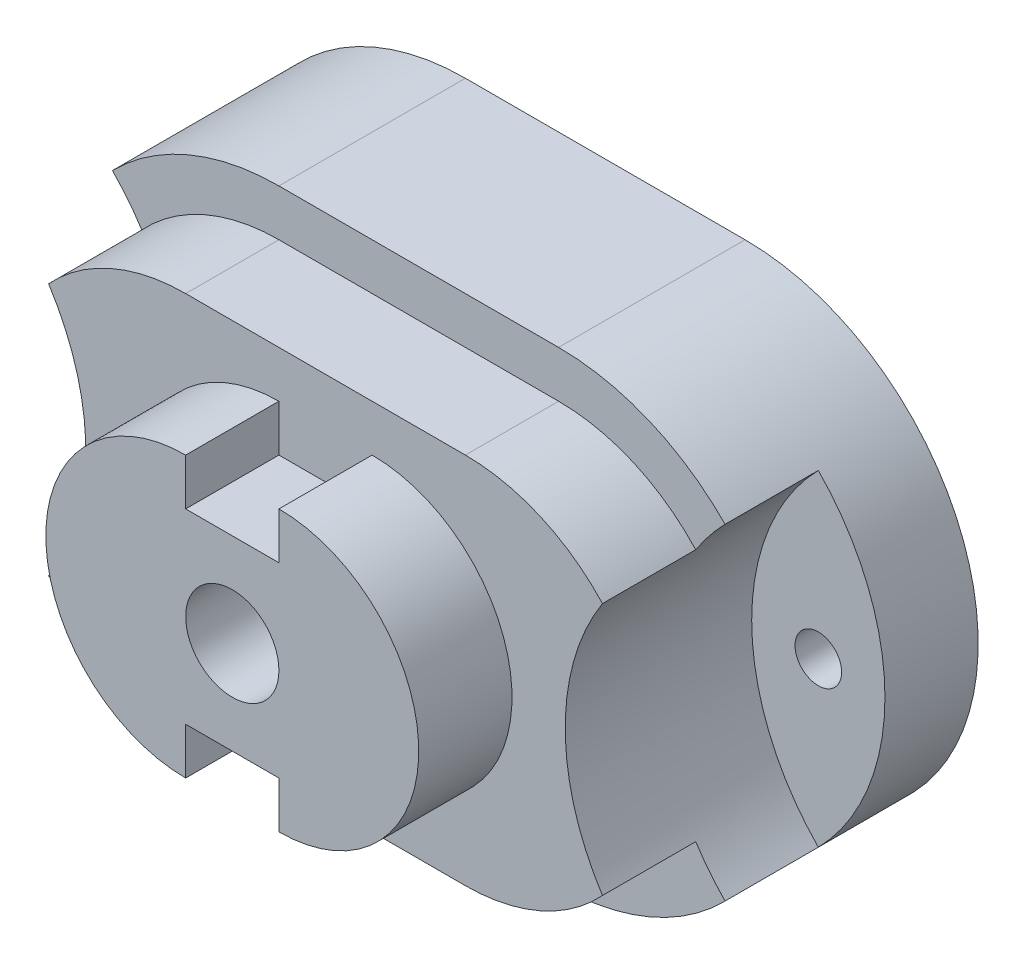
ISO-10303-21;
HEADER;
FILE_DESCRIPTION(('STEP AP214'),'2;1');
FILE_NAME('part.step','',(''),(''),'','','');
FILE_SCHEMA(('AUTOMOTIVE_DESIGN { 1 0 10303 214 1 1 1 1 }'));
ENDSEC;
DATA;
#1=APPLICATION_CONTEXT('core data for automotive mechanical design processes');
#2=APPLICATION_PROTOCOL_DEFINITION('international standard','automotive_design',2000,#1);
#3=PRODUCT_CONTEXT('',#1,'mechanical');
#4=PRODUCT('Part','Part','',(#3));
#5=PRODUCT_RELATED_PRODUCT_CATEGORY('part','',(#4));
#6=PRODUCT_DEFINITION_FORMATION('','',#4);
#7=PRODUCT_DEFINITION_CONTEXT('part definition',#1,'design');
#8=PRODUCT_DEFINITION('design','',#6,#7);
#9=PRODUCT_DEFINITION_SHAPE('','',#8);
#10=(LENGTH_UNIT() NAMED_UNIT(*) SI_UNIT(.MILLI.,.METRE.));
#11=(NAMED_UNIT(*) PLANE_ANGLE_UNIT() SI_UNIT($,.RADIAN.));
#12=(NAMED_UNIT(*) SI_UNIT($,.STERADIAN.) SOLID_ANGLE_UNIT());
#13=UNCERTAINTY_MEASURE_WITH_UNIT(LENGTH_MEASURE(1.E-05),#10,'distance_accuracy_value','');
#14=(GEOMETRIC_REPRESENTATION_CONTEXT(3) GLOBAL_UNCERTAINTY_ASSIGNED_CONTEXT((#13)) GLOBAL_UNIT_ASSIGNED_CONTEXT((#10,
#11,#12)) REPRESENTATION_CONTEXT('',''));
#15=CARTESIAN_POINT('',(0.,0.,0.));
#16=DIRECTION('',(0.,0.,1.));
#17=DIRECTION('',(1.,0.,0.));
#18=AXIS2_PLACEMENT_3D('',#15,#16,#17);
#19=CARTESIAN_POINT('',(-30.,25.,30.));
#20=DIRECTION('',(0.,0.,1.));
#21=DIRECTION('',(1.,0.,0.));
#22=AXIS2_PLACEMENT_3D('',#19,#20,#21);
#23=PLANE('',#22);
#24=CARTESIAN_POINT('',(35.7071421427143,25.,30.));
#25=DIRECTION('',(0.,0.,1.));
#26=DIRECTION('',(1.,0.,0.));
#27=AXIS2_PLACEMENT_3D('',#24,#25,#26);
#28=CIRCLE('',#27,25.);
#29=CARTESIAN_POINT('',(14.7029408822941,38.558153613666,30.));
#30=VERTEX_POINT('',#29);
#31=CARTESIAN_POINT('',(14.7029408822941,11.441846386334,30.));
#32=VERTEX_POINT('',#31);
#33=EDGE_CURVE('E11',#30,#32,#28,.T.);
#34=ORIENTED_EDGE('',*,*,#33,.F.);
#35=CARTESIAN_POINT('',(0.,25.,30.));
#36=DIRECTION('',(0.,0.,1.));
#37=DIRECTION('',(1.,0.,0.));
#38=AXIS2_PLACEMENT_3D('',#35,#36,#37);
#39=CIRCLE('',#38,20.);
#40=CARTESIAN_POINT('',(0.,45.,30.));
#41=VERTEX_POINT('',#40);
#42=EDGE_CURVE('E308',#30,#41,#39,.T.);
#43=ORIENTED_EDGE('',*,*,#42,.T.);
#44=DIRECTION('',(-1.,0.,0.));
#45=VECTOR('',#44,1.);
#46=CARTESIAN_POINT('',(-30.,45.,30.));
#47=LINE('',#46,#45);
#48=CARTESIAN_POINT('',(-30.,45.,30.));
#49=VERTEX_POINT('',#48);
#50=EDGE_CURVE('E312',#41,#49,#47,.T.);
#51=ORIENTED_EDGE('',*,*,#50,.T.);
#52=CARTESIAN_POINT('',(-30.,25.,30.));
#53=DIRECTION('',(0.,0.,1.));
#54=DIRECTION('',(1.,0.,0.));
#55=AXIS2_PLACEMENT_3D('',#52,#53,#54);
#56=CIRCLE('',#55,20.);
#57=CARTESIAN_POINT('',(-44.7029408822941,38.558153613666,30.));
#58=VERTEX_POINT('',#57);
#59=EDGE_CURVE('E302',#49,#58,#56,.T.);
#60=ORIENTED_EDGE('',*,*,#59,.T.);
#61=CARTESIAN_POINT('',(-65.7071421427142,25.,30.));
#62=DIRECTION('',(0.,0.,1.));
#63=DIRECTION('',(1.,0.,0.));
#64=AXIS2_PLACEMENT_3D('',#61,#62,#63);
#65=CIRCLE('',#64,25.);
#66=CARTESIAN_POINT('',(-44.7029408822941,11.441846386334,30.));
#67=VERTEX_POINT('',#66);
#68=EDGE_CURVE('E41',#67,#58,#65,.T.);
#69=ORIENTED_EDGE('',*,*,#68,.F.);
#70=CARTESIAN_POINT('',(-30.,5.,30.));
#71=VERTEX_POINT('',#70);
#72=EDGE_CURVE('E306',#67,#71,#56,.T.);
#73=ORIENTED_EDGE('',*,*,#72,.T.);
#74=DIRECTION('',(1.,0.,0.));
#75=VECTOR('',#74,1.);
#76=CARTESIAN_POINT('',(-30.,5.,30.));
#77=LINE('',#76,#75);
#78=CARTESIAN_POINT('',(0.,4.99999999999999,30.));
#79=VERTEX_POINT('',#78);
#80=EDGE_CURVE('E305',#71,#79,#77,.T.);
#81=ORIENTED_EDGE('',*,*,#80,.T.);
#82=EDGE_CURVE('E309',#79,#32,#39,.T.);
#83=ORIENTED_EDGE('',*,*,#82,.T.);
#84=EDGE_LOOP('',(#34,#43,#51,#60,#69,#73,#81,#83));
#85=FACE_BOUND('',#84,.T.);
#86=DIRECTION('',(0.,1.,0.));
#87=VECTOR('',#86,1.);
#88=CARTESIAN_POINT('',(-20.,10.,30.));
#89=LINE('',#88,#87);
#90=CARTESIAN_POINT('',(-20.,10.,30.));
#91=VERTEX_POINT('',#90);
#92=CARTESIAN_POINT('',(-20.,15.,30.));
#93=VERTEX_POINT('',#92);
#94=EDGE_CURVE('E244',#91,#93,#89,.T.);
#95=ORIENTED_EDGE('',*,*,#94,.F.);
#96=CARTESIAN_POINT('',(-20.,25.,30.));
#97=DIRECTION('',(0.,0.,1.));
#98=DIRECTION('',(-1.,0.,0.));
#99=AXIS2_PLACEMENT_3D('',#96,#97,#98);
#100=CIRCLE('',#99,15.);
#101=CARTESIAN_POINT('',(-20.,40.,30.));
#102=VERTEX_POINT('',#101);
#103=EDGE_CURVE('E222',#102,#91,#100,.T.);
#104=ORIENTED_EDGE('',*,*,#103,.F.);
#105=DIRECTION('',(0.,1.,0.));
#106=VECTOR('',#105,1.);
#107=CARTESIAN_POINT('',(-20.,40.,30.));
#108=LINE('',#107,#106);
#109=CARTESIAN_POINT('',(-20.,35.,30.));
#110=VERTEX_POINT('',#109);
#111=EDGE_CURVE('E227',#110,#102,#108,.T.);
#112=ORIENTED_EDGE('',*,*,#111,.F.);
#113=DIRECTION('',(-1.,0.,0.));
#114=VECTOR('',#113,1.);
#115=CARTESIAN_POINT('',(-20.,35.,30.));
#116=LINE('',#115,#114);
#117=CARTESIAN_POINT('',(-10.,35.,30.));
#118=VERTEX_POINT('',#117);
#119=EDGE_CURVE('E254',#118,#110,#116,.T.);
#120=ORIENTED_EDGE('',*,*,#119,.F.);
#121=DIRECTION('',(0.,-1.,0.));
#122=VECTOR('',#121,1.);
#123=CARTESIAN_POINT('',(-10.,35.,30.));
#124=LINE('',#123,#122);
#125=CARTESIAN_POINT('',(-10.,40.,30.));
#126=VERTEX_POINT('',#125);
#127=EDGE_CURVE('E252',#126,#118,#124,.T.);
#128=ORIENTED_EDGE('',*,*,#127,.F.);
#129=CARTESIAN_POINT('',(-9.99999999999999,25.,30.));
#130=DIRECTION('',(0.,0.,1.));
#131=DIRECTION('',(1.,0.,0.));
#132=AXIS2_PLACEMENT_3D('',#129,#130,#131);
#133=CIRCLE('',#132,15.);
#134=CARTESIAN_POINT('',(-9.99999999999998,10.,30.));
#135=VERTEX_POINT('',#134);
#136=EDGE_CURVE('E250',#135,#126,#133,.T.);
#137=ORIENTED_EDGE('',*,*,#136,.F.);
#138=DIRECTION('',(0.,-1.,0.));
#139=VECTOR('',#138,1.);
#140=CARTESIAN_POINT('',(-9.99999999999998,15.,30.));
#141=LINE('',#140,#139);
#142=CARTESIAN_POINT('',(-9.99999999999998,15.,30.));
#143=VERTEX_POINT('',#142);
#144=EDGE_CURVE('E248',#143,#135,#141,.T.);
#145=ORIENTED_EDGE('',*,*,#144,.F.);
#146=DIRECTION('',(1.,0.,0.));
#147=VECTOR('',#146,1.);
#148=CARTESIAN_POINT('',(-20.,15.,30.));
#149=LINE('',#148,#147);
#150=EDGE_CURVE('E246',#93,#143,#149,.T.);
#151=ORIENTED_EDGE('',*,*,#150,.F.);
#152=EDGE_LOOP('',(#95,#104,#112,#120,#128,#137,#145,#151));
#153=FACE_BOUND('',#152,.T.);
#154=ADVANCED_FACE('F33',(#85,#153),#23,.T.);
#155=CARTESIAN_POINT('',(0.,25.,30.));
#156=DIRECTION('',(0.,0.,-1.));
#157=DIRECTION('',(-1.,0.,0.));
#158=AXIS2_PLACEMENT_3D('',#155,#156,#157);
#159=CYLINDRICAL_SURFACE('',#158,20.);
#160=CARTESIAN_POINT('',(0.,25.,20.));
#161=DIRECTION('',(0.,0.,1.));
#162=DIRECTION('',(1.,0.,0.));
#163=AXIS2_PLACEMENT_3D('',#160,#161,#162);
#164=CIRCLE('',#163,20.);
#165=CARTESIAN_POINT('',(0.,4.99999999999999,20.));
#166=VERTEX_POINT('',#165);
#167=CARTESIAN_POINT('',(14.7029408822941,11.441846386334,20.));
#168=VERTEX_POINT('',#167);
#169=EDGE_CURVE('E321',#166,#168,#164,.T.);
#170=ORIENTED_EDGE('',*,*,#169,.T.);
#171=DIRECTION('',(0.,0.,1.));
#172=VECTOR('',#171,1.);
#173=CARTESIAN_POINT('',(14.7029408822941,11.441846386334,20.));
#174=LINE('',#173,#172);
#175=EDGE_CURVE('E283',#168,#32,#174,.T.);
#176=ORIENTED_EDGE('',*,*,#175,.T.);
#177=ORIENTED_EDGE('',*,*,#82,.F.);
#178=DIRECTION('',(0.,0.,-1.));
#179=VECTOR('',#178,1.);
#180=CARTESIAN_POINT('',(0.,4.99999999999999,30.));
#181=LINE('',#180,#179);
#182=EDGE_CURVE('E333',#79,#166,#181,.T.);
#183=ORIENTED_EDGE('',*,*,#182,.T.);
#184=EDGE_LOOP('',(#170,#176,#177,#183));
#185=FACE_BOUND('',#184,.T.);
#186=ADVANCED_FACE('F446',(#185),#159,.T.);
#187=CARTESIAN_POINT('',(-30.,25.,30.));
#188=DIRECTION('',(0.,0.,-1.));
#189=DIRECTION('',(-1.,0.,0.));
#190=AXIS2_PLACEMENT_3D('',#187,#188,#189);
#191=CYLINDRICAL_SURFACE('',#190,20.);
#192=CARTESIAN_POINT('',(-30.,25.,20.));
#193=DIRECTION('',(0.,0.,1.));
#194=DIRECTION('',(1.,0.,0.));
#195=AXIS2_PLACEMENT_3D('',#192,#193,#194);
#196=CIRCLE('',#195,20.);
#197=CARTESIAN_POINT('',(-30.,45.,20.));
#198=VERTEX_POINT('',#197);
#199=CARTESIAN_POINT('',(-44.7029408822941,38.558153613666,20.));
#200=VERTEX_POINT('',#199);
#201=EDGE_CURVE('E301',#198,#200,#196,.T.);
#202=ORIENTED_EDGE('',*,*,#201,.T.);
#203=DIRECTION('',(0.,0.,1.));
#204=VECTOR('',#203,1.);
#205=CARTESIAN_POINT('',(-44.7029408822941,38.558153613666,25.));
#206=LINE('',#205,#204);
#207=EDGE_CURVE('E296',#200,#58,#206,.T.);
#208=ORIENTED_EDGE('',*,*,#207,.T.);
#209=ORIENTED_EDGE('',*,*,#59,.F.);
#210=DIRECTION('',(0.,0.,-1.));
#211=VECTOR('',#210,1.);
#212=CARTESIAN_POINT('',(-30.,45.,30.));
#213=LINE('',#212,#211);
#214=EDGE_CURVE('E314',#49,#198,#213,.T.);
#215=ORIENTED_EDGE('',*,*,#214,.T.);
#216=EDGE_LOOP('',(#202,#208,#209,#215));
#217=FACE_BOUND('',#216,.T.);
#218=ADVANCED_FACE('F414',(#217),#191,.T.);
#219=CARTESIAN_POINT('',(-30.,25.,20.));
#220=DIRECTION('',(0.,0.,1.));
#221=DIRECTION('',(1.,0.,0.));
#222=AXIS2_PLACEMENT_3D('',#219,#220,#221);
#223=PLANE('',#222);
#224=CARTESIAN_POINT('',(35.7071421427143,25.,20.));
#225=DIRECTION('',(0.,0.,1.));
#226=DIRECTION('',(1.,0.,0.));
#227=AXIS2_PLACEMENT_3D('',#224,#225,#226);
#228=CIRCLE('',#227,25.);
#229=CARTESIAN_POINT('',(17.8535710713571,42.5,20.));
#230=VERTEX_POINT('',#229);
#231=CARTESIAN_POINT('',(14.7029408822941,38.558153613666,20.));
#232=VERTEX_POINT('',#231);
#233=EDGE_CURVE('E281',#230,#232,#228,.T.);
#234=ORIENTED_EDGE('',*,*,#233,.F.);
#235=CARTESIAN_POINT('',(0.,25.,20.));
#236=DIRECTION('',(0.,0.,1.));
#237=DIRECTION('',(1.,0.,0.));
#238=AXIS2_PLACEMENT_3D('',#235,#236,#237);
#239=CIRCLE('',#238,25.);
#240=CARTESIAN_POINT('',(0.,50.,20.));
#241=VERTEX_POINT('',#240);
#242=EDGE_CURVE('E362',#230,#241,#239,.T.);
#243=ORIENTED_EDGE('',*,*,#242,.T.);
#244=DIRECTION('',(-1.,0.,0.));
#245=VECTOR('',#244,1.);
#246=CARTESIAN_POINT('',(-30.,50.,20.));
#247=LINE('',#246,#245);
#248=CARTESIAN_POINT('',(-30.,50.,20.));
#249=VERTEX_POINT('',#248);
#250=EDGE_CURVE('E366',#241,#249,#247,.T.);
#251=ORIENTED_EDGE('',*,*,#250,.T.);
#252=CARTESIAN_POINT('',(-30.,25.,20.));
#253=DIRECTION('',(0.,0.,1.));
#254=DIRECTION('',(1.,0.,0.));
#255=AXIS2_PLACEMENT_3D('',#252,#253,#254);
#256=CIRCLE('',#255,25.);
#257=CARTESIAN_POINT('',(-47.8535710713571,42.5,20.));
#258=VERTEX_POINT('',#257);
#259=EDGE_CURVE('E356',#249,#258,#256,.T.);
#260=ORIENTED_EDGE('',*,*,#259,.T.);
#261=CARTESIAN_POINT('',(-65.7071421427142,25.,20.));
#262=DIRECTION('',(0.,0.,1.));
#263=DIRECTION('',(1.,0.,0.));
#264=AXIS2_PLACEMENT_3D('',#261,#262,#263);
#265=CIRCLE('',#264,25.);
#266=EDGE_CURVE('E299',#200,#258,#265,.T.);
#267=ORIENTED_EDGE('',*,*,#266,.F.);
#268=ORIENTED_EDGE('',*,*,#201,.F.);
#269=DIRECTION('',(-1.,0.,0.));
#270=VECTOR('',#269,1.);
#271=CARTESIAN_POINT('',(-30.,45.,20.));
#272=LINE('',#271,#270);
#273=CARTESIAN_POINT('',(0.,45.,20.));
#274=VERTEX_POINT('',#273);
#275=EDGE_CURVE('E324',#274,#198,#272,.T.);
#276=ORIENTED_EDGE('',*,*,#275,.F.);
#277=EDGE_CURVE('E325',#232,#274,#164,.T.);
#278=ORIENTED_EDGE('',*,*,#277,.F.);
#279=EDGE_LOOP('',(#234,#243,#251,#260,#267,#268,#276,#278));
#280=FACE_BOUND('',#279,.T.);
#281=ADVANCED_FACE('F419',(#280),#223,.T.);
#282=CARTESIAN_POINT('',(-30.,25.,20.));
#283=DIRECTION('',(0.,0.,-1.));
#284=DIRECTION('',(-1.,0.,0.));
#285=AXIS2_PLACEMENT_3D('',#282,#283,#284);
#286=CYLINDRICAL_SURFACE('',#285,25.);
#287=CARTESIAN_POINT('',(-47.8535710713571,7.50000000000001,20.));
#288=VERTEX_POINT('',#287);
#289=CARTESIAN_POINT('',(-30.,0.,20.));
#290=VERTEX_POINT('',#289);
#291=EDGE_CURVE('E360',#288,#290,#256,.T.);
#292=ORIENTED_EDGE('',*,*,#291,.F.);
#293=DIRECTION('',(0.,0.,1.));
#294=VECTOR('',#293,1.);
#295=CARTESIAN_POINT('',(-47.8535710713571,7.5,10.));
#296=LINE('',#295,#294);
#297=CARTESIAN_POINT('',(-47.8535710713571,7.50000000000001,10.));
#298=VERTEX_POINT('',#297);
#299=EDGE_CURVE('E350',#298,#288,#296,.T.);
#300=ORIENTED_EDGE('',*,*,#299,.F.);
#301=CARTESIAN_POINT('',(-30.,25.,10.));
#302=DIRECTION('',(0.,0.,1.));
#303=DIRECTION('',(1.,0.,0.));
#304=AXIS2_PLACEMENT_3D('',#301,#302,#303);
#305=CIRCLE('',#304,25.);
#306=CARTESIAN_POINT('',(-47.8535710713571,42.5,10.));
#307=VERTEX_POINT('',#306);
#308=EDGE_CURVE('E346',#307,#298,#305,.T.);
#309=ORIENTED_EDGE('',*,*,#308,.F.);
#310=DIRECTION('',(0.,0.,1.));
#311=VECTOR('',#310,1.);
#312=CARTESIAN_POINT('',(-47.8535710713571,42.5,10.));
#313=LINE('',#312,#311);
#314=EDGE_CURVE('E351',#307,#258,#313,.T.);
#315=ORIENTED_EDGE('',*,*,#314,.T.);
#316=ORIENTED_EDGE('',*,*,#259,.F.);
#317=DIRECTION('',(0.,0.,-1.));
#318=VECTOR('',#317,1.);
#319=CARTESIAN_POINT('',(-30.,50.,20.));
#320=LINE('',#319,#318);
#321=CARTESIAN_POINT('',(-30.,50.,0.));
#322=VERTEX_POINT('',#321);
#323=EDGE_CURVE('E368',#249,#322,#320,.T.);
#324=ORIENTED_EDGE('',*,*,#323,.T.);
#325=CARTESIAN_POINT('',(-30.,25.,0.));
#326=DIRECTION('',(0.,0.,1.));
#327=DIRECTION('',(1.,0.,0.));
#328=AXIS2_PLACEMENT_3D('',#325,#326,#327);
#329=CIRCLE('',#328,25.);
#330=CARTESIAN_POINT('',(-30.,0.,0.));
#331=VERTEX_POINT('',#330);
#332=EDGE_CURVE('E354',#322,#331,#329,.T.);
#333=ORIENTED_EDGE('',*,*,#332,.T.);
#334=DIRECTION('',(0.,0.,-1.));
#335=VECTOR('',#334,1.);
#336=CARTESIAN_POINT('',(-30.,0.,20.));
#337=LINE('',#336,#335);
#338=EDGE_CURVE('E385',#290,#331,#337,.T.);
#339=ORIENTED_EDGE('',*,*,#338,.F.);
#340=EDGE_LOOP('',(#292,#300,#309,#315,#316,#324,#333,#339));
#341=FACE_BOUND('',#340,.T.);
#342=ADVANCED_FACE('F35',(#341),#286,.T.);
#343=CARTESIAN_POINT('',(-30.,0.,20.));
#344=DIRECTION('',(0.,1.,0.));
#345=DIRECTION('',(0.,0.,1.));
#346=AXIS2_PLACEMENT_3D('',#343,#344,#345);
#347=PLANE('',#346);
#348=DIRECTION('',(1.,0.,0.));
#349=VECTOR('',#348,1.);
#350=CARTESIAN_POINT('',(-30.,0.,0.));
#351=LINE('',#350,#349);
#352=CARTESIAN_POINT('',(0.,0.,0.));
#353=VERTEX_POINT('',#352);
#354=EDGE_CURVE('E371',#331,#353,#351,.T.);
#355=ORIENTED_EDGE('',*,*,#354,.T.);
#356=DIRECTION('',(0.,0.,-1.));
#357=VECTOR('',#356,1.);
#358=CARTESIAN_POINT('',(0.,0.,20.));
#359=LINE('',#358,#357);
#360=CARTESIAN_POINT('',(0.,0.,20.));
#361=VERTEX_POINT('',#360);
#362=EDGE_CURVE('E382',#361,#353,#359,.T.);
#363=ORIENTED_EDGE('',*,*,#362,.F.);
#364=DIRECTION('',(1.,0.,0.));
#365=VECTOR('',#364,1.);
#366=CARTESIAN_POINT('',(-30.,0.,20.));
#367=LINE('',#366,#365);
#368=EDGE_CURVE('E359',#290,#361,#367,.T.);
#369=ORIENTED_EDGE('',*,*,#368,.F.);
#370=ORIENTED_EDGE('',*,*,#338,.T.);
#371=EDGE_LOOP('',(#355,#363,#369,#370));
#372=FACE_BOUND('',#371,.T.);
#373=ADVANCED_FACE('F434',(#372),#347,.F.);
#374=CARTESIAN_POINT('',(0.,25.,20.));
#375=DIRECTION('',(0.,0.,-1.));
#376=DIRECTION('',(-1.,0.,0.));
#377=AXIS2_PLACEMENT_3D('',#374,#375,#376);
#378=CYLINDRICAL_SURFACE('',#377,25.);
#379=ORIENTED_EDGE('',*,*,#242,.F.);
#380=DIRECTION('',(0.,0.,1.));
#381=VECTOR('',#380,1.);
#382=CARTESIAN_POINT('',(17.8535710713571,42.5,10.));
#383=LINE('',#382,#381);
#384=CARTESIAN_POINT('',(17.8535710713571,42.5,10.));
#385=VERTEX_POINT('',#384);
#386=EDGE_CURVE('E342',#385,#230,#383,.T.);
#387=ORIENTED_EDGE('',*,*,#386,.F.);
#388=CARTESIAN_POINT('',(0.,25.,10.));
#389=DIRECTION('',(0.,0.,1.));
#390=DIRECTION('',(-1.,0.,0.));
#391=AXIS2_PLACEMENT_3D('',#388,#389,#390);
#392=CIRCLE('',#391,25.);
#393=CARTESIAN_POINT('',(17.8535710713571,7.50000000000001,10.));
#394=VERTEX_POINT('',#393);
#395=EDGE_CURVE('E339',#394,#385,#392,.T.);
#396=ORIENTED_EDGE('',*,*,#395,.F.);
#397=DIRECTION('',(0.,0.,1.));
#398=VECTOR('',#397,1.);
#399=CARTESIAN_POINT('',(17.8535710713571,7.5,10.));
#400=LINE('',#399,#398);
#401=CARTESIAN_POINT('',(17.8535710713571,7.50000000000001,20.));
#402=VERTEX_POINT('',#401);
#403=EDGE_CURVE('E343',#394,#402,#400,.T.);
#404=ORIENTED_EDGE('',*,*,#403,.T.);
#405=EDGE_CURVE('E363',#361,#402,#239,.T.);
#406=ORIENTED_EDGE('',*,*,#405,.F.);
#407=ORIENTED_EDGE('',*,*,#362,.T.);
#408=CARTESIAN_POINT('',(0.,25.,0.));
#409=DIRECTION('',(0.,0.,1.));
#410=DIRECTION('',(1.,0.,0.));
#411=AXIS2_PLACEMENT_3D('',#408,#409,#410);
#412=CIRCLE('',#411,25.);
#413=CARTESIAN_POINT('',(0.,50.,0.));
#414=VERTEX_POINT('',#413);
#415=EDGE_CURVE('E373',#353,#414,#412,.T.);
#416=ORIENTED_EDGE('',*,*,#415,.T.);
#417=DIRECTION('',(0.,0.,-1.));
#418=VECTOR('',#417,1.);
#419=CARTESIAN_POINT('',(0.,50.,20.));
#420=LINE('',#419,#418);
#421=EDGE_CURVE('E379',#241,#414,#420,.T.);
#422=ORIENTED_EDGE('',*,*,#421,.F.);
#423=EDGE_LOOP('',(#379,#387,#396,#404,#406,#407,#416,#422));
#424=FACE_BOUND('',#423,.T.);
#425=ADVANCED_FACE('F442',(#424),#378,.T.);
#426=CARTESIAN_POINT('',(-30.,50.,20.));
#427=DIRECTION('',(0.,-1.,0.));
#428=DIRECTION('',(0.,0.,-1.));
#429=AXIS2_PLACEMENT_3D('',#426,#427,#428);
#430=PLANE('',#429);
#431=DIRECTION('',(-1.,0.,0.));
#432=VECTOR('',#431,1.);
#433=CARTESIAN_POINT('',(-30.,50.,0.));
#434=LINE('',#433,#432);
#435=EDGE_CURVE('E375',#414,#322,#434,.T.);
#436=ORIENTED_EDGE('',*,*,#435,.T.);
#437=ORIENTED_EDGE('',*,*,#323,.F.);
#438=ORIENTED_EDGE('',*,*,#250,.F.);
#439=ORIENTED_EDGE('',*,*,#421,.T.);
#440=EDGE_LOOP('',(#436,#437,#438,#439));
#441=FACE_BOUND('',#440,.T.);
#442=ADVANCED_FACE('F454',(#441),#430,.F.);
#443=CARTESIAN_POINT('',(35.7071421427143,25.,20.));
#444=DIRECTION('',(0.,0.,1.));
#445=DIRECTION('',(1.,0.,0.));
#446=AXIS2_PLACEMENT_3D('',#443,#444,#445);
#447=CIRCLE('',#446,25.);
#448=EDGE_CURVE('E286',#168,#402,#447,.T.);
#449=ORIENTED_EDGE('',*,*,#448,.F.);
#450=ORIENTED_EDGE('',*,*,#169,.F.);
#451=DIRECTION('',(1.,0.,0.));
#452=VECTOR('',#451,1.);
#453=CARTESIAN_POINT('',(-30.,5.,20.));
#454=LINE('',#453,#452);
#455=CARTESIAN_POINT('',(-30.,5.,20.));
#456=VERTEX_POINT('',#455);
#457=EDGE_CURVE('E317',#456,#166,#454,.T.);
#458=ORIENTED_EDGE('',*,*,#457,.F.);
#459=CARTESIAN_POINT('',(-44.7029408822941,11.441846386334,20.));
#460=VERTEX_POINT('',#459);
#461=EDGE_CURVE('E318',#460,#456,#196,.T.);
#462=ORIENTED_EDGE('',*,*,#461,.F.);
#463=CARTESIAN_POINT('',(-65.7071421427142,25.,20.));
#464=DIRECTION('',(0.,0.,1.));
#465=DIRECTION('',(1.,0.,0.));
#466=AXIS2_PLACEMENT_3D('',#463,#464,#465);
#467=CIRCLE('',#466,25.);
#468=EDGE_CURVE('E294',#288,#460,#467,.T.);
#469=ORIENTED_EDGE('',*,*,#468,.F.);
#470=ORIENTED_EDGE('',*,*,#291,.T.);
#471=ORIENTED_EDGE('',*,*,#368,.T.);
#472=ORIENTED_EDGE('',*,*,#405,.T.);
#473=EDGE_LOOP('',(#449,#450,#458,#462,#469,#470,#471,#472));
#474=FACE_BOUND('',#473,.T.);
#475=ADVANCED_FACE('F402',(#474),#223,.T.);
#476=CARTESIAN_POINT('',(-30.,25.,0.));
#477=DIRECTION('',(0.,0.,1.));
#478=DIRECTION('',(1.,0.,0.));
#479=AXIS2_PLACEMENT_3D('',#476,#477,#478);
#480=PLANE('',#479);
#481=CARTESIAN_POINT('',(-47.8535710713571,25.,0.));
#482=DIRECTION('',(0.,0.,1.));
#483=DIRECTION('',(1.,0.,0.));
#484=AXIS2_PLACEMENT_3D('',#481,#482,#483);
#485=CIRCLE('',#484,2.5);
#486=CARTESIAN_POINT('',(-45.3535710713571,25.,0.));
#487=VERTEX_POINT('',#486);
#488=EDGE_CURVE('E209',#487,#487,#485,.T.);
#489=ORIENTED_EDGE('',*,*,#488,.T.);
#490=EDGE_LOOP('',(#489));
#491=FACE_BOUND('',#490,.T.);
#492=CARTESIAN_POINT('',(17.8535710713571,25.,0.));
#493=DIRECTION('',(0.,0.,1.));
#494=DIRECTION('',(1.,0.,0.));
#495=AXIS2_PLACEMENT_3D('',#492,#493,#494);
#496=CIRCLE('',#495,2.5);
#497=CARTESIAN_POINT('',(20.3535710713571,25.,0.));
#498=VERTEX_POINT('',#497);
#499=EDGE_CURVE('E219',#498,#498,#496,.T.);
#500=ORIENTED_EDGE('',*,*,#499,.T.);
#501=EDGE_LOOP('',(#500));
#502=FACE_BOUND('',#501,.T.);
#503=ORIENTED_EDGE('',*,*,#332,.F.);
#504=ORIENTED_EDGE('',*,*,#435,.F.);
#505=ORIENTED_EDGE('',*,*,#415,.F.);
#506=ORIENTED_EDGE('',*,*,#354,.F.);
#507=EDGE_LOOP('',(#503,#504,#505,#506));
#508=FACE_BOUND('',#507,.T.);
#509=ADVANCED_FACE('F438',(#491,#502,#508),#480,.F.);
#510=CARTESIAN_POINT('',(0.,0.,10.));
#511=DIRECTION('',(0.,0.,1.));
#512=DIRECTION('',(1.,0.,0.));
#513=AXIS2_PLACEMENT_3D('',#510,#511,#512);
#514=PLANE('',#513);
#515=CARTESIAN_POINT('',(-47.8535710713571,25.,10.));
#516=DIRECTION('',(0.,0.,1.));
#517=DIRECTION('',(1.,0.,0.));
#518=AXIS2_PLACEMENT_3D('',#515,#516,#517);
#519=CIRCLE('',#518,2.5);
#520=CARTESIAN_POINT('',(-45.3535710713571,25.,10.));
#521=VERTEX_POINT('',#520);
#522=EDGE_CURVE('E205',#521,#521,#519,.T.);
#523=ORIENTED_EDGE('',*,*,#522,.F.);
#524=EDGE_LOOP('',(#523));
#525=FACE_BOUND('',#524,.T.);
#526=ORIENTED_EDGE('',*,*,#308,.T.);
#527=CARTESIAN_POINT('',(-65.7071421427142,25.,10.));
#528=DIRECTION('',(0.,0.,1.));
#529=DIRECTION('',(-1.,0.,0.));
#530=AXIS2_PLACEMENT_3D('',#527,#528,#529);
#531=CIRCLE('',#530,25.);
#532=EDGE_CURVE('E288',#298,#307,#531,.T.);
#533=ORIENTED_EDGE('',*,*,#532,.T.);
#534=EDGE_LOOP('',(#526,#533));
#535=FACE_BOUND('',#534,.T.);
#536=ADVANCED_FACE('F429',(#525,#535),#514,.T.);
#537=CARTESIAN_POINT('',(0.,25.,10.));
#538=DIRECTION('',(0.,0.,-1.));
#539=DIRECTION('',(-1.,0.,0.));
#540=AXIS2_PLACEMENT_3D('',#537,#538,#539);
#541=PLANE('',#540);
#542=CARTESIAN_POINT('',(17.8535710713571,25.,10.));
#543=DIRECTION('',(0.,0.,1.));
#544=DIRECTION('',(1.,0.,0.));
#545=AXIS2_PLACEMENT_3D('',#542,#543,#544);
#546=CIRCLE('',#545,2.5);
#547=CARTESIAN_POINT('',(20.3535710713571,25.,10.));
#548=VERTEX_POINT('',#547);
#549=EDGE_CURVE('E216',#548,#548,#546,.T.);
#550=ORIENTED_EDGE('',*,*,#549,.F.);
#551=EDGE_LOOP('',(#550));
#552=FACE_BOUND('',#551,.T.);
#553=ORIENTED_EDGE('',*,*,#395,.T.);
#554=CARTESIAN_POINT('',(35.7071421427143,25.,10.));
#555=DIRECTION('',(0.,0.,1.));
#556=DIRECTION('',(1.,0.,0.));
#557=AXIS2_PLACEMENT_3D('',#554,#555,#556);
#558=CIRCLE('',#557,25.);
#559=EDGE_CURVE('E277',#385,#394,#558,.T.);
#560=ORIENTED_EDGE('',*,*,#559,.T.);
#561=EDGE_LOOP('',(#553,#560));
#562=FACE_BOUND('',#561,.T.);
#563=ADVANCED_FACE('F480',(#552,#562),#541,.F.);
#564=ORIENTED_EDGE('',*,*,#72,.F.);
#565=DIRECTION('',(0.,0.,1.));
#566=VECTOR('',#565,1.);
#567=CARTESIAN_POINT('',(-44.7029408822941,11.441846386334,25.));
#568=LINE('',#567,#566);
#569=EDGE_CURVE('E291',#67,#460,#568,.F.);
#570=ORIENTED_EDGE('',*,*,#569,.T.);
#571=ORIENTED_EDGE('',*,*,#461,.T.);
#572=DIRECTION('',(0.,0.,-1.));
#573=VECTOR('',#572,1.);
#574=CARTESIAN_POINT('',(-30.,5.,30.));
#575=LINE('',#574,#573);
#576=EDGE_CURVE('E336',#71,#456,#575,.T.);
#577=ORIENTED_EDGE('',*,*,#576,.F.);
#578=EDGE_LOOP('',(#564,#570,#571,#577));
#579=FACE_BOUND('',#578,.T.);
#580=ADVANCED_FACE('F398',(#579),#191,.T.);
#581=CARTESIAN_POINT('',(-30.,5.,30.));
#582=DIRECTION('',(0.,1.,0.));
#583=DIRECTION('',(0.,0.,1.));
#584=AXIS2_PLACEMENT_3D('',#581,#582,#583);
#585=PLANE('',#584);
#586=ORIENTED_EDGE('',*,*,#457,.T.);
#587=ORIENTED_EDGE('',*,*,#182,.F.);
#588=ORIENTED_EDGE('',*,*,#80,.F.);
#589=ORIENTED_EDGE('',*,*,#576,.T.);
#590=EDGE_LOOP('',(#586,#587,#588,#589));
#591=FACE_BOUND('',#590,.T.);
#592=ADVANCED_FACE('F406',(#591),#585,.F.);
#593=ORIENTED_EDGE('',*,*,#42,.F.);
#594=DIRECTION('',(0.,0.,1.));
#595=VECTOR('',#594,1.);
#596=CARTESIAN_POINT('',(14.7029408822941,38.558153613666,20.));
#597=LINE('',#596,#595);
#598=EDGE_CURVE('E55',#30,#232,#597,.F.);
#599=ORIENTED_EDGE('',*,*,#598,.T.);
#600=ORIENTED_EDGE('',*,*,#277,.T.);
#601=DIRECTION('',(0.,0.,-1.));
#602=VECTOR('',#601,1.);
#603=CARTESIAN_POINT('',(0.,45.,30.));
#604=LINE('',#603,#602);
#605=EDGE_CURVE('E330',#41,#274,#604,.T.);
#606=ORIENTED_EDGE('',*,*,#605,.F.);
#607=EDGE_LOOP('',(#593,#599,#600,#606));
#608=FACE_BOUND('',#607,.T.);
#609=ADVANCED_FACE('F449',(#608),#159,.T.);
#610=CARTESIAN_POINT('',(-30.,45.,30.));
#611=DIRECTION('',(0.,-1.,0.));
#612=DIRECTION('',(1.,0.,0.));
#613=AXIS2_PLACEMENT_3D('',#610,#611,#612);
#614=PLANE('',#613);
#615=ORIENTED_EDGE('',*,*,#275,.T.);
#616=ORIENTED_EDGE('',*,*,#214,.F.);
#617=ORIENTED_EDGE('',*,*,#50,.F.);
#618=ORIENTED_EDGE('',*,*,#605,.T.);
#619=EDGE_LOOP('',(#615,#616,#617,#618));
#620=FACE_BOUND('',#619,.T.);
#621=ADVANCED_FACE('F451',(#620),#614,.F.);
#622=CARTESIAN_POINT('',(-65.7071421427142,25.,10.));
#623=DIRECTION('',(0.,0.,1.));
#624=DIRECTION('',(1.,0.,0.));
#625=AXIS2_PLACEMENT_3D('',#622,#623,#624);
#626=CYLINDRICAL_SURFACE('',#625,25.);
#627=ORIENTED_EDGE('',*,*,#266,.T.);
#628=ORIENTED_EDGE('',*,*,#314,.F.);
#629=ORIENTED_EDGE('',*,*,#532,.F.);
#630=ORIENTED_EDGE('',*,*,#299,.T.);
#631=ORIENTED_EDGE('',*,*,#468,.T.);
#632=ORIENTED_EDGE('',*,*,#569,.F.);
#633=ORIENTED_EDGE('',*,*,#68,.T.);
#634=ORIENTED_EDGE('',*,*,#207,.F.);
#635=EDGE_LOOP('',(#627,#628,#629,#630,#631,#632,#633,#634));
#636=FACE_BOUND('',#635,.T.);
#637=ADVANCED_FACE('F416',(#636),#626,.F.);
#638=CARTESIAN_POINT('',(35.7071421427143,25.,10.));
#639=DIRECTION('',(0.,0.,1.));
#640=DIRECTION('',(1.,0.,0.));
#641=AXIS2_PLACEMENT_3D('',#638,#639,#640);
#642=CYLINDRICAL_SURFACE('',#641,25.);
#643=ORIENTED_EDGE('',*,*,#448,.T.);
#644=ORIENTED_EDGE('',*,*,#403,.F.);
#645=ORIENTED_EDGE('',*,*,#559,.F.);
#646=ORIENTED_EDGE('',*,*,#386,.T.);
#647=ORIENTED_EDGE('',*,*,#233,.T.);
#648=ORIENTED_EDGE('',*,*,#598,.F.);
#649=ORIENTED_EDGE('',*,*,#33,.T.);
#650=ORIENTED_EDGE('',*,*,#175,.F.);
#651=EDGE_LOOP('',(#643,#644,#645,#646,#647,#648,#649,#650));
#652=FACE_BOUND('',#651,.T.);
#653=ADVANCED_FACE('F447',(#652),#642,.F.);
#654=CARTESIAN_POINT('',(-20.,25.,40.));
#655=DIRECTION('',(0.,0.,-1.));
#656=DIRECTION('',(-1.,0.,0.));
#657=AXIS2_PLACEMENT_3D('',#654,#655,#656);
#658=CYLINDRICAL_SURFACE('',#657,15.);
#659=ORIENTED_EDGE('',*,*,#103,.T.);
#660=DIRECTION('',(0.,0.,-1.));
#661=VECTOR('',#660,1.);
#662=CARTESIAN_POINT('',(-20.,10.,40.));
#663=LINE('',#662,#661);
#664=CARTESIAN_POINT('',(-20.,10.,40.));
#665=VERTEX_POINT('',#664);
#666=EDGE_CURVE('E275',#665,#91,#663,.T.);
#667=ORIENTED_EDGE('',*,*,#666,.F.);
#668=CARTESIAN_POINT('',(-20.,25.,40.));
#669=DIRECTION('',(0.,0.,1.));
#670=DIRECTION('',(-1.,0.,0.));
#671=AXIS2_PLACEMENT_3D('',#668,#669,#670);
#672=CIRCLE('',#671,15.);
#673=CARTESIAN_POINT('',(-20.,40.,40.));
#674=VERTEX_POINT('',#673);
#675=EDGE_CURVE('E223',#674,#665,#672,.T.);
#676=ORIENTED_EDGE('',*,*,#675,.F.);
#677=DIRECTION('',(0.,0.,-1.));
#678=VECTOR('',#677,1.);
#679=CARTESIAN_POINT('',(-20.,40.,40.));
#680=LINE('',#679,#678);
#681=EDGE_CURVE('E241',#674,#102,#680,.T.);
#682=ORIENTED_EDGE('',*,*,#681,.T.);
#683=EDGE_LOOP('',(#659,#667,#676,#682));
#684=FACE_BOUND('',#683,.T.);
#685=ADVANCED_FACE('F534',(#684),#658,.T.);
#686=CARTESIAN_POINT('',(-20.,10.,40.));
#687=DIRECTION('',(-1.,0.,0.));
#688=DIRECTION('',(0.,-1.,0.));
#689=AXIS2_PLACEMENT_3D('',#686,#687,#688);
#690=PLANE('',#689);
#691=ORIENTED_EDGE('',*,*,#94,.T.);
#692=DIRECTION('',(0.,0.,-1.));
#693=VECTOR('',#692,1.);
#694=CARTESIAN_POINT('',(-20.,15.,40.));
#695=LINE('',#694,#693);
#696=CARTESIAN_POINT('',(-20.,15.,40.));
#697=VERTEX_POINT('',#696);
#698=EDGE_CURVE('E272',#697,#93,#695,.T.);
#699=ORIENTED_EDGE('',*,*,#698,.F.);
#700=DIRECTION('',(0.,1.,0.));
#701=VECTOR('',#700,1.);
#702=CARTESIAN_POINT('',(-20.,10.,40.));
#703=LINE('',#702,#701);
#704=EDGE_CURVE('E226',#665,#697,#703,.T.);
#705=ORIENTED_EDGE('',*,*,#704,.F.);
#706=ORIENTED_EDGE('',*,*,#666,.T.);
#707=EDGE_LOOP('',(#691,#699,#705,#706));
#708=FACE_BOUND('',#707,.T.);
#709=ADVANCED_FACE('F530',(#708),#690,.F.);
#710=CARTESIAN_POINT('',(-20.,15.,40.));
#711=DIRECTION('',(0.,1.,0.));
#712=DIRECTION('',(0.,0.,1.));
#713=AXIS2_PLACEMENT_3D('',#710,#711,#712);
#714=PLANE('',#713);
#715=ORIENTED_EDGE('',*,*,#150,.T.);
#716=DIRECTION('',(0.,0.,-1.));
#717=VECTOR('',#716,1.);
#718=CARTESIAN_POINT('',(-9.99999999999998,15.,40.));
#719=LINE('',#718,#717);
#720=CARTESIAN_POINT('',(-9.99999999999998,15.,40.));
#721=VERTEX_POINT('',#720);
#722=EDGE_CURVE('E269',#721,#143,#719,.T.);
#723=ORIENTED_EDGE('',*,*,#722,.F.);
#724=DIRECTION('',(1.,0.,0.));
#725=VECTOR('',#724,1.);
#726=CARTESIAN_POINT('',(-20.,15.,40.));
#727=LINE('',#726,#725);
#728=EDGE_CURVE('E229',#697,#721,#727,.T.);
#729=ORIENTED_EDGE('',*,*,#728,.F.);
#730=ORIENTED_EDGE('',*,*,#698,.T.);
#731=EDGE_LOOP('',(#715,#723,#729,#730));
#732=FACE_BOUND('',#731,.T.);
#733=ADVANCED_FACE('F526',(#732),#714,.F.);
#734=CARTESIAN_POINT('',(-9.99999999999998,15.,40.));
#735=DIRECTION('',(1.,0.,0.));
#736=DIRECTION('',(0.,1.,0.));
#737=AXIS2_PLACEMENT_3D('',#734,#735,#736);
#738=PLANE('',#737);
#739=ORIENTED_EDGE('',*,*,#144,.T.);
#740=DIRECTION('',(0.,0.,-1.));
#741=VECTOR('',#740,1.);
#742=CARTESIAN_POINT('',(-9.99999999999998,10.,40.));
#743=LINE('',#742,#741);
#744=CARTESIAN_POINT('',(-9.99999999999998,10.,40.));
#745=VERTEX_POINT('',#744);
#746=EDGE_CURVE('E266',#745,#135,#743,.T.);
#747=ORIENTED_EDGE('',*,*,#746,.F.);
#748=DIRECTION('',(0.,-1.,0.));
#749=VECTOR('',#748,1.);
#750=CARTESIAN_POINT('',(-9.99999999999998,15.,40.));
#751=LINE('',#750,#749);
#752=EDGE_CURVE('E231',#721,#745,#751,.T.);
#753=ORIENTED_EDGE('',*,*,#752,.F.);
#754=ORIENTED_EDGE('',*,*,#722,.T.);
#755=EDGE_LOOP('',(#739,#747,#753,#754));
#756=FACE_BOUND('',#755,.T.);
#757=ADVANCED_FACE('F522',(#756),#738,.F.);
#758=CARTESIAN_POINT('',(-9.99999999999999,25.,40.));
#759=DIRECTION('',(0.,0.,-1.));
#760=DIRECTION('',(-1.,0.,0.));
#761=AXIS2_PLACEMENT_3D('',#758,#759,#760);
#762=CYLINDRICAL_SURFACE('',#761,15.);
#763=ORIENTED_EDGE('',*,*,#136,.T.);
#764=DIRECTION('',(0.,0.,-1.));
#765=VECTOR('',#764,1.);
#766=CARTESIAN_POINT('',(-10.,40.,40.));
#767=LINE('',#766,#765);
#768=CARTESIAN_POINT('',(-10.,40.,40.));
#769=VERTEX_POINT('',#768);
#770=EDGE_CURVE('E263',#769,#126,#767,.T.);
#771=ORIENTED_EDGE('',*,*,#770,.F.);
#772=CARTESIAN_POINT('',(-9.99999999999999,25.,40.));
#773=DIRECTION('',(0.,0.,1.));
#774=DIRECTION('',(1.,0.,0.));
#775=AXIS2_PLACEMENT_3D('',#772,#773,#774);
#776=CIRCLE('',#775,15.);
#777=EDGE_CURVE('E233',#745,#769,#776,.T.);
#778=ORIENTED_EDGE('',*,*,#777,.F.);
#779=ORIENTED_EDGE('',*,*,#746,.T.);
#780=EDGE_LOOP('',(#763,#771,#778,#779));
#781=FACE_BOUND('',#780,.T.);
#782=ADVANCED_FACE('F518',(#781),#762,.T.);
#783=CARTESIAN_POINT('',(-10.,35.,40.));
#784=DIRECTION('',(1.,0.,0.));
#785=DIRECTION('',(0.,0.,-1.));
#786=AXIS2_PLACEMENT_3D('',#783,#784,#785);
#787=PLANE('',#786);
#788=ORIENTED_EDGE('',*,*,#127,.T.);
#789=DIRECTION('',(0.,0.,-1.));
#790=VECTOR('',#789,1.);
#791=CARTESIAN_POINT('',(-10.,35.,40.));
#792=LINE('',#791,#790);
#793=CARTESIAN_POINT('',(-10.,35.,40.));
#794=VERTEX_POINT('',#793);
#795=EDGE_CURVE('E260',#794,#118,#792,.T.);
#796=ORIENTED_EDGE('',*,*,#795,.F.);
#797=DIRECTION('',(0.,-1.,0.));
#798=VECTOR('',#797,1.);
#799=CARTESIAN_POINT('',(-10.,35.,40.));
#800=LINE('',#799,#798);
#801=EDGE_CURVE('E235',#769,#794,#800,.T.);
#802=ORIENTED_EDGE('',*,*,#801,.F.);
#803=ORIENTED_EDGE('',*,*,#770,.T.);
#804=EDGE_LOOP('',(#788,#796,#802,#803));
#805=FACE_BOUND('',#804,.T.);
#806=ADVANCED_FACE('F514',(#805),#787,.F.);
#807=CARTESIAN_POINT('',(-20.,35.,40.));
#808=DIRECTION('',(0.,-1.,0.));
#809=DIRECTION('',(0.,0.,-1.));
#810=AXIS2_PLACEMENT_3D('',#807,#808,#809);
#811=PLANE('',#810);
#812=ORIENTED_EDGE('',*,*,#119,.T.);
#813=DIRECTION('',(0.,0.,-1.));
#814=VECTOR('',#813,1.);
#815=CARTESIAN_POINT('',(-20.,35.,40.));
#816=LINE('',#815,#814);
#817=CARTESIAN_POINT('',(-20.,35.,40.));
#818=VERTEX_POINT('',#817);
#819=EDGE_CURVE('E48',#818,#110,#816,.T.);
#820=ORIENTED_EDGE('',*,*,#819,.F.);
#821=DIRECTION('',(-1.,0.,0.));
#822=VECTOR('',#821,1.);
#823=CARTESIAN_POINT('',(-20.,35.,40.));
#824=LINE('',#823,#822);
#825=EDGE_CURVE('E237',#794,#818,#824,.T.);
#826=ORIENTED_EDGE('',*,*,#825,.F.);
#827=ORIENTED_EDGE('',*,*,#795,.T.);
#828=EDGE_LOOP('',(#812,#820,#826,#827));
#829=FACE_BOUND('',#828,.T.);
#830=ADVANCED_FACE('F511',(#829),#811,.F.);
#831=CARTESIAN_POINT('',(-20.,40.,40.));
#832=DIRECTION('',(-1.,0.,0.));
#833=DIRECTION('',(0.,0.,1.));
#834=AXIS2_PLACEMENT_3D('',#831,#832,#833);
#835=PLANE('',#834);
#836=ORIENTED_EDGE('',*,*,#111,.T.);
#837=ORIENTED_EDGE('',*,*,#681,.F.);
#838=DIRECTION('',(0.,1.,0.));
#839=VECTOR('',#838,1.);
#840=CARTESIAN_POINT('',(-20.,40.,40.));
#841=LINE('',#840,#839);
#842=EDGE_CURVE('E239',#818,#674,#841,.T.);
#843=ORIENTED_EDGE('',*,*,#842,.F.);
#844=ORIENTED_EDGE('',*,*,#819,.T.);
#845=EDGE_LOOP('',(#836,#837,#843,#844));
#846=FACE_BOUND('',#845,.T.);
#847=ADVANCED_FACE('F505',(#846),#835,.F.);
#848=CARTESIAN_POINT('',(-20.,25.,40.));
#849=DIRECTION('',(0.,0.,-1.));
#850=DIRECTION('',(-1.,0.,0.));
#851=AXIS2_PLACEMENT_3D('',#848,#849,#850);
#852=PLANE('',#851);
#853=CARTESIAN_POINT('',(-15.,25.,40.));
#854=DIRECTION('',(0.,0.,1.));
#855=DIRECTION('',(1.,0.,0.));
#856=AXIS2_PLACEMENT_3D('',#853,#854,#855);
#857=CIRCLE('',#856,4.99999999999999);
#858=CARTESIAN_POINT('',(-10.,25.,40.));
#859=VERTEX_POINT('',#858);
#860=EDGE_CURVE('E206',#859,#859,#857,.T.);
#861=ORIENTED_EDGE('',*,*,#860,.F.);
#862=EDGE_LOOP('',(#861));
#863=FACE_BOUND('',#862,.T.);
#864=ORIENTED_EDGE('',*,*,#675,.T.);
#865=ORIENTED_EDGE('',*,*,#704,.T.);
#866=ORIENTED_EDGE('',*,*,#728,.T.);
#867=ORIENTED_EDGE('',*,*,#752,.T.);
#868=ORIENTED_EDGE('',*,*,#777,.T.);
#869=ORIENTED_EDGE('',*,*,#801,.T.);
#870=ORIENTED_EDGE('',*,*,#825,.T.);
#871=ORIENTED_EDGE('',*,*,#842,.T.);
#872=EDGE_LOOP('',(#864,#865,#866,#867,#868,#869,#870,#871));
#873=FACE_BOUND('',#872,.T.);
#874=ADVANCED_FACE('F496',(#863,#873),#852,.F.);
#875=CARTESIAN_POINT('',(17.8535710713571,25.,-23.));
#876=DIRECTION('',(0.,0.,1.));
#877=DIRECTION('',(1.,0.,0.));
#878=AXIS2_PLACEMENT_3D('',#875,#876,#877);
#879=CYLINDRICAL_SURFACE('',#878,2.5);
#880=ORIENTED_EDGE('',*,*,#549,.T.);
#881=EDGE_LOOP('',(#880));
#882=FACE_BOUND('',#881,.T.);
#883=ORIENTED_EDGE('',*,*,#499,.F.);
#884=EDGE_LOOP('',(#883));
#885=FACE_BOUND('',#884,.T.);
#886=ADVANCED_FACE('F494',(#882,#885),#879,.F.);
#887=CARTESIAN_POINT('',(-47.8535710713571,25.,-23.));
#888=DIRECTION('',(0.,0.,1.));
#889=DIRECTION('',(1.,0.,0.));
#890=AXIS2_PLACEMENT_3D('',#887,#888,#889);
#891=CYLINDRICAL_SURFACE('',#890,2.5);
#892=ORIENTED_EDGE('',*,*,#522,.T.);
#893=EDGE_LOOP('',(#892));
#894=FACE_BOUND('',#893,.T.);
#895=ORIENTED_EDGE('',*,*,#488,.F.);
#896=EDGE_LOOP('',(#895));
#897=FACE_BOUND('',#896,.T.);
#898=ADVANCED_FACE('F199',(#894,#897),#891,.F.);
#899=CARTESIAN_POINT('',(-15.,25.,20.));
#900=DIRECTION('',(0.,0.,1.));
#901=DIRECTION('',(1.,0.,0.));
#902=AXIS2_PLACEMENT_3D('',#899,#900,#901);
#903=CONICAL_SURFACE('',#902,5.,1.07337748997651);
#904=CARTESIAN_POINT('',(-15.,25.,17.2852215018078));
#905=VERTEX_POINT('',#904);
#906=VERTEX_LOOP('',#905);
#907=FACE_BOUND('',#906,.T.);
#908=CARTESIAN_POINT('',(-15.,25.,20.));
#909=DIRECTION('',(0.,0.,1.));
#910=DIRECTION('',(1.,0.,0.));
#911=AXIS2_PLACEMENT_3D('',#908,#909,#910);
#912=CIRCLE('',#911,5.);
#913=CARTESIAN_POINT('',(-10.,25.,20.));
#914=VERTEX_POINT('',#913);
#915=EDGE_CURVE('E203',#914,#914,#912,.T.);
#916=ORIENTED_EDGE('',*,*,#915,.T.);
#917=EDGE_LOOP('',(#916));
#918=FACE_BOUND('',#917,.T.);
#919=ADVANCED_FACE('F195',(#907,#918),#903,.F.);
#920=CARTESIAN_POINT('',(-15.,25.,40.));
#921=DIRECTION('',(0.,0.,1.));
#922=DIRECTION('',(1.,0.,0.));
#923=AXIS2_PLACEMENT_3D('',#920,#921,#922);
#924=CYLINDRICAL_SURFACE('',#923,4.99999999999999);
#925=ORIENTED_EDGE('',*,*,#915,.F.);
#926=EDGE_LOOP('',(#925));
#927=FACE_BOUND('',#926,.T.);
#928=ORIENTED_EDGE('',*,*,#860,.T.);
#929=EDGE_LOOP('',(#928));
#930=FACE_BOUND('',#929,.T.);
#931=ADVANCED_FACE('F198',(#927,#930),#924,.F.);
#932=CLOSED_SHELL('',(#154,#186,#218,#281,#342,#373,#425,#442,#475,#509,#536,#563,#580,#592,
#609,#621,#637,#653,#685,#709,#733,#757,#782,#806,#830,#847,#874,#886,#898,#919,#931));
#933=MANIFOLD_SOLID_BREP('B2',#932);
#934=ADVANCED_BREP_SHAPE_REPRESENTATION('',(#18,#933),#14);
#935=SHAPE_DEFINITION_REPRESENTATION(#9,#934);
ENDSEC;
END-ISO-10303-21;
